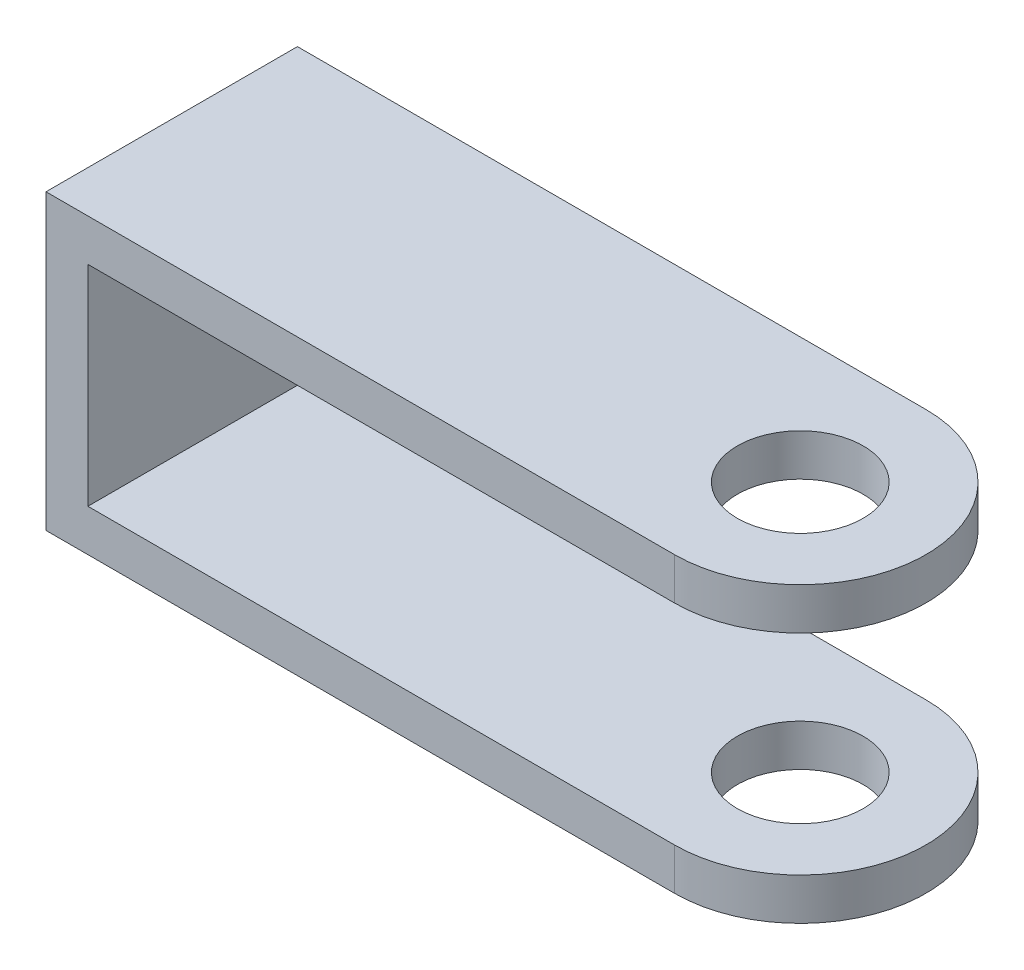
ISO-10303-21;
HEADER;
FILE_DESCRIPTION(('STEP AP214'),'2;1');
FILE_NAME('part.step','',(''),(''),'','','');
FILE_SCHEMA(('AUTOMOTIVE_DESIGN { 1 0 10303 214 1 1 1 1 }'));
ENDSEC;
DATA;
#1=APPLICATION_CONTEXT('core data for automotive mechanical design processes');
#2=APPLICATION_PROTOCOL_DEFINITION('international standard','automotive_design',2000,#1);
#3=PRODUCT_CONTEXT('',#1,'mechanical');
#4=PRODUCT('Part','Part','',(#3));
#5=PRODUCT_RELATED_PRODUCT_CATEGORY('part','',(#4));
#6=PRODUCT_DEFINITION_FORMATION('','',#4);
#7=PRODUCT_DEFINITION_CONTEXT('part definition',#1,'design');
#8=PRODUCT_DEFINITION('design','',#6,#7);
#9=PRODUCT_DEFINITION_SHAPE('','',#8);
#10=(LENGTH_UNIT() NAMED_UNIT(*) SI_UNIT(.MILLI.,.METRE.));
#11=(NAMED_UNIT(*) PLANE_ANGLE_UNIT() SI_UNIT($,.RADIAN.));
#12=(NAMED_UNIT(*) SI_UNIT($,.STERADIAN.) SOLID_ANGLE_UNIT());
#13=UNCERTAINTY_MEASURE_WITH_UNIT(LENGTH_MEASURE(1.E-05),#10,'distance_accuracy_value','');
#14=(GEOMETRIC_REPRESENTATION_CONTEXT(3) GLOBAL_UNCERTAINTY_ASSIGNED_CONTEXT((#13)) GLOBAL_UNIT_ASSIGNED_CONTEXT((#10,
#11,#12)) REPRESENTATION_CONTEXT('',''));
#15=CARTESIAN_POINT('',(0.,0.,0.));
#16=DIRECTION('',(0.,0.,1.));
#17=DIRECTION('',(1.,0.,0.));
#18=AXIS2_PLACEMENT_3D('',#15,#16,#17);
#19=CARTESIAN_POINT('',(10.,70.,30.));
#20=DIRECTION('',(-1.,0.,0.));
#21=DIRECTION('',(0.,0.,1.));
#22=AXIS2_PLACEMENT_3D('',#19,#20,#21);
#23=PLANE('',#22);
#24=DIRECTION('',(0.,0.,-1.));
#25=VECTOR('',#24,1.);
#26=CARTESIAN_POINT('',(10.,60.,30.));
#27=LINE('',#26,#25);
#28=CARTESIAN_POINT('',(10.,60.,30.));
#29=VERTEX_POINT('',#28);
#30=CARTESIAN_POINT('',(10.,60.,-30.));
#31=VERTEX_POINT('',#30);
#32=EDGE_CURVE('E11',#29,#31,#27,.T.);
#33=ORIENTED_EDGE('',*,*,#32,.F.);
#34=DIRECTION('',(0.,-1.,0.));
#35=VECTOR('',#34,1.);
#36=CARTESIAN_POINT('',(10.,70.,30.));
#37=LINE('',#36,#35);
#38=CARTESIAN_POINT('',(10.,10.,30.));
#39=VERTEX_POINT('',#38);
#40=EDGE_CURVE('E49',#29,#39,#37,.T.);
#41=ORIENTED_EDGE('',*,*,#40,.T.);
#42=DIRECTION('',(0.,0.,-1.));
#43=VECTOR('',#42,1.);
#44=CARTESIAN_POINT('',(10.,10.,30.));
#45=LINE('',#44,#43);
#46=CARTESIAN_POINT('',(10.,10.,-30.));
#47=VERTEX_POINT('',#46);
#48=EDGE_CURVE('E129',#39,#47,#45,.T.);
#49=ORIENTED_EDGE('',*,*,#48,.T.);
#50=DIRECTION('',(0.,-1.,0.));
#51=VECTOR('',#50,1.);
#52=CARTESIAN_POINT('',(10.,70.,-30.));
#53=LINE('',#52,#51);
#54=EDGE_CURVE('E137',#31,#47,#53,.T.);
#55=ORIENTED_EDGE('',*,*,#54,.F.);
#56=EDGE_LOOP('',(#33,#41,#49,#55));
#57=FACE_BOUND('',#56,.T.);
#58=ADVANCED_FACE('F34',(#57),#23,.F.);
#59=CARTESIAN_POINT('',(150.,10.,0.));
#60=DIRECTION('',(0.,-1.,0.));
#61=DIRECTION('',(0.,0.,-1.));
#62=AXIS2_PLACEMENT_3D('',#59,#60,#61);
#63=PLANE('',#62);
#64=CARTESIAN_POINT('',(150.,10.,0.));
#65=DIRECTION('',(0.,1.,0.));
#66=DIRECTION('',(0.,0.,1.));
#67=AXIS2_PLACEMENT_3D('',#64,#65,#66);
#68=CIRCLE('',#67,15.);
#69=CARTESIAN_POINT('',(150.,10.,15.));
#70=VERTEX_POINT('',#69);
#71=EDGE_CURVE('E102',#70,#70,#68,.T.);
#72=ORIENTED_EDGE('',*,*,#71,.F.);
#73=EDGE_LOOP('',(#72));
#74=FACE_BOUND('',#73,.T.);
#75=ORIENTED_EDGE('',*,*,#48,.F.);
#76=DIRECTION('',(1.,0.,0.));
#77=VECTOR('',#76,1.);
#78=CARTESIAN_POINT('',(150.,10.,30.));
#79=LINE('',#78,#77);
#80=CARTESIAN_POINT('',(150.,10.,30.));
#81=VERTEX_POINT('',#80);
#82=EDGE_CURVE('E118',#39,#81,#79,.T.);
#83=ORIENTED_EDGE('',*,*,#82,.T.);
#84=CARTESIAN_POINT('',(150.,10.,0.));
#85=DIRECTION('',(0.,1.,0.));
#86=DIRECTION('',(0.,0.,-1.));
#87=AXIS2_PLACEMENT_3D('',#84,#85,#86);
#88=CIRCLE('',#87,30.);
#89=CARTESIAN_POINT('',(150.,10.,-30.));
#90=VERTEX_POINT('',#89);
#91=EDGE_CURVE('E58',#81,#90,#88,.T.);
#92=ORIENTED_EDGE('',*,*,#91,.T.);
#93=DIRECTION('',(-1.,0.,0.));
#94=VECTOR('',#93,1.);
#95=CARTESIAN_POINT('',(0.,10.,-30.));
#96=LINE('',#95,#94);
#97=EDGE_CURVE('E87',#90,#47,#96,.T.);
#98=ORIENTED_EDGE('',*,*,#97,.T.);
#99=EDGE_LOOP('',(#75,#83,#92,#98));
#100=FACE_BOUND('',#99,.T.);
#101=ADVANCED_FACE('F198',(#74,#100),#63,.F.);
#102=CARTESIAN_POINT('',(150.,0.,0.));
#103=DIRECTION('',(0.,-1.,0.));
#104=DIRECTION('',(0.,0.,-1.));
#105=AXIS2_PLACEMENT_3D('',#102,#103,#104);
#106=PLANE('',#105);
#107=DIRECTION('',(-1.,0.,0.));
#108=VECTOR('',#107,1.);
#109=CARTESIAN_POINT('',(0.,0.,-30.));
#110=LINE('',#109,#108);
#111=CARTESIAN_POINT('',(150.,0.,-30.));
#112=VERTEX_POINT('',#111);
#113=CARTESIAN_POINT('',(0.,0.,-30.));
#114=VERTEX_POINT('',#113);
#115=EDGE_CURVE('E94',#112,#114,#110,.T.);
#116=ORIENTED_EDGE('',*,*,#115,.F.);
#117=CARTESIAN_POINT('',(150.,0.,0.));
#118=DIRECTION('',(0.,1.,0.));
#119=DIRECTION('',(0.,0.,-1.));
#120=AXIS2_PLACEMENT_3D('',#117,#118,#119);
#121=CIRCLE('',#120,30.);
#122=CARTESIAN_POINT('',(150.,0.,30.));
#123=VERTEX_POINT('',#122);
#124=EDGE_CURVE('E77',#123,#112,#121,.T.);
#125=ORIENTED_EDGE('',*,*,#124,.F.);
#126=DIRECTION('',(1.,0.,0.));
#127=VECTOR('',#126,1.);
#128=CARTESIAN_POINT('',(150.,0.,30.));
#129=LINE('',#128,#127);
#130=CARTESIAN_POINT('',(0.,0.,30.));
#131=VERTEX_POINT('',#130);
#132=EDGE_CURVE('E88',#131,#123,#129,.T.);
#133=ORIENTED_EDGE('',*,*,#132,.F.);
#134=DIRECTION('',(0.,0.,1.));
#135=VECTOR('',#134,1.);
#136=CARTESIAN_POINT('',(0.,0.,-30.));
#137=LINE('',#136,#135);
#138=EDGE_CURVE('E101',#114,#131,#137,.T.);
#139=ORIENTED_EDGE('',*,*,#138,.F.);
#140=EDGE_LOOP('',(#116,#125,#133,#139));
#141=FACE_BOUND('',#140,.T.);
#142=CARTESIAN_POINT('',(150.,0.,0.));
#143=DIRECTION('',(0.,1.,0.));
#144=DIRECTION('',(0.,0.,1.));
#145=AXIS2_PLACEMENT_3D('',#142,#143,#144);
#146=CIRCLE('',#145,15.);
#147=CARTESIAN_POINT('',(150.,0.,15.));
#148=VERTEX_POINT('',#147);
#149=EDGE_CURVE('E106',#148,#148,#146,.T.);
#150=ORIENTED_EDGE('',*,*,#149,.T.);
#151=EDGE_LOOP('',(#150));
#152=FACE_BOUND('',#151,.T.);
#153=ADVANCED_FACE('F98',(#141,#152),#106,.T.);
#154=CARTESIAN_POINT('',(0.,10.,-30.));
#155=DIRECTION('',(0.,0.,1.));
#156=DIRECTION('',(1.,0.,0.));
#157=AXIS2_PLACEMENT_3D('',#154,#155,#156);
#158=PLANE('',#157);
#159=DIRECTION('',(-1.,0.,0.));
#160=VECTOR('',#159,1.);
#161=CARTESIAN_POINT('',(0.,70.,-30.));
#162=LINE('',#161,#160);
#163=CARTESIAN_POINT('',(150.,70.,-30.));
#164=VERTEX_POINT('',#163);
#165=CARTESIAN_POINT('',(0.,70.,-30.));
#166=VERTEX_POINT('',#165);
#167=EDGE_CURVE('E127',#164,#166,#162,.T.);
#168=ORIENTED_EDGE('',*,*,#167,.F.);
#169=DIRECTION('',(0.,1.,0.));
#170=VECTOR('',#169,1.);
#171=CARTESIAN_POINT('',(150.,60.,-30.));
#172=LINE('',#171,#170);
#173=CARTESIAN_POINT('',(150.,60.,-30.));
#174=VERTEX_POINT('',#173);
#175=EDGE_CURVE('E132',#174,#164,#172,.T.);
#176=ORIENTED_EDGE('',*,*,#175,.F.);
#177=DIRECTION('',(-1.,0.,0.));
#178=VECTOR('',#177,1.);
#179=CARTESIAN_POINT('',(0.,60.,-30.));
#180=LINE('',#179,#178);
#181=EDGE_CURVE('E160',#174,#31,#180,.T.);
#182=ORIENTED_EDGE('',*,*,#181,.T.);
#183=ORIENTED_EDGE('',*,*,#54,.T.);
#184=ORIENTED_EDGE('',*,*,#97,.F.);
#185=DIRECTION('',(0.,-1.,0.));
#186=VECTOR('',#185,1.);
#187=CARTESIAN_POINT('',(150.,10.,-30.));
#188=LINE('',#187,#186);
#189=EDGE_CURVE('E80',#90,#112,#188,.T.);
#190=ORIENTED_EDGE('',*,*,#189,.T.);
#191=ORIENTED_EDGE('',*,*,#115,.T.);
#192=DIRECTION('',(0.,-1.,0.));
#193=VECTOR('',#192,1.);
#194=CARTESIAN_POINT('',(0.,10.,-30.));
#195=LINE('',#194,#193);
#196=EDGE_CURVE('E42',#166,#114,#195,.T.);
#197=ORIENTED_EDGE('',*,*,#196,.F.);
#198=EDGE_LOOP('',(#168,#176,#182,#183,#184,#190,#191,#197));
#199=FACE_BOUND('',#198,.T.);
#200=ADVANCED_FACE('F36',(#199),#158,.F.);
#201=CARTESIAN_POINT('',(0.,10.,-30.));
#202=DIRECTION('',(1.,0.,0.));
#203=DIRECTION('',(0.,0.,-1.));
#204=AXIS2_PLACEMENT_3D('',#201,#202,#203);
#205=PLANE('',#204);
#206=ORIENTED_EDGE('',*,*,#196,.T.);
#207=ORIENTED_EDGE('',*,*,#138,.T.);
#208=DIRECTION('',(0.,-1.,0.));
#209=VECTOR('',#208,1.);
#210=CARTESIAN_POINT('',(0.,10.,30.));
#211=LINE('',#210,#209);
#212=CARTESIAN_POINT('',(0.,70.,30.));
#213=VERTEX_POINT('',#212);
#214=EDGE_CURVE('E113',#213,#131,#211,.T.);
#215=ORIENTED_EDGE('',*,*,#214,.F.);
#216=DIRECTION('',(0.,0.,1.));
#217=VECTOR('',#216,1.);
#218=CARTESIAN_POINT('',(0.,70.,30.));
#219=LINE('',#218,#217);
#220=EDGE_CURVE('E131',#166,#213,#219,.T.);
#221=ORIENTED_EDGE('',*,*,#220,.F.);
#222=EDGE_LOOP('',(#206,#207,#215,#221));
#223=FACE_BOUND('',#222,.T.);
#224=ADVANCED_FACE('F211',(#223),#205,.F.);
#225=CARTESIAN_POINT('',(150.,10.,30.));
#226=DIRECTION('',(0.,0.,-1.));
#227=DIRECTION('',(-1.,0.,0.));
#228=AXIS2_PLACEMENT_3D('',#225,#226,#227);
#229=PLANE('',#228);
#230=ORIENTED_EDGE('',*,*,#214,.T.);
#231=ORIENTED_EDGE('',*,*,#132,.T.);
#232=DIRECTION('',(0.,-1.,0.));
#233=VECTOR('',#232,1.);
#234=CARTESIAN_POINT('',(150.,10.,30.));
#235=LINE('',#234,#233);
#236=EDGE_CURVE('E83',#81,#123,#235,.T.);
#237=ORIENTED_EDGE('',*,*,#236,.F.);
#238=ORIENTED_EDGE('',*,*,#82,.F.);
#239=ORIENTED_EDGE('',*,*,#40,.F.);
#240=DIRECTION('',(1.,0.,0.));
#241=VECTOR('',#240,1.);
#242=CARTESIAN_POINT('',(150.,60.,30.));
#243=LINE('',#242,#241);
#244=CARTESIAN_POINT('',(150.,60.,30.));
#245=VERTEX_POINT('',#244);
#246=EDGE_CURVE('E157',#29,#245,#243,.T.);
#247=ORIENTED_EDGE('',*,*,#246,.T.);
#248=DIRECTION('',(0.,1.,0.));
#249=VECTOR('',#248,1.);
#250=CARTESIAN_POINT('',(150.,60.,30.));
#251=LINE('',#250,#249);
#252=CARTESIAN_POINT('',(150.,70.,30.));
#253=VERTEX_POINT('',#252);
#254=EDGE_CURVE('E155',#245,#253,#251,.T.);
#255=ORIENTED_EDGE('',*,*,#254,.T.);
#256=DIRECTION('',(1.,0.,0.));
#257=VECTOR('',#256,1.);
#258=CARTESIAN_POINT('',(0.,70.,30.));
#259=LINE('',#258,#257);
#260=EDGE_CURVE('E142',#213,#253,#259,.T.);
#261=ORIENTED_EDGE('',*,*,#260,.F.);
#262=EDGE_LOOP('',(#230,#231,#237,#238,#239,#247,#255,#261));
#263=FACE_BOUND('',#262,.T.);
#264=ADVANCED_FACE('F209',(#263),#229,.F.);
#265=CARTESIAN_POINT('',(150.,10.,0.));
#266=DIRECTION('',(0.,-1.,0.));
#267=DIRECTION('',(0.,0.,-1.));
#268=AXIS2_PLACEMENT_3D('',#265,#266,#267);
#269=CYLINDRICAL_SURFACE('',#268,30.);
#270=ORIENTED_EDGE('',*,*,#124,.T.);
#271=ORIENTED_EDGE('',*,*,#189,.F.);
#272=ORIENTED_EDGE('',*,*,#91,.F.);
#273=ORIENTED_EDGE('',*,*,#236,.T.);
#274=EDGE_LOOP('',(#270,#271,#272,#273));
#275=FACE_BOUND('',#274,.T.);
#276=ADVANCED_FACE('F79',(#275),#269,.T.);
#277=CARTESIAN_POINT('',(150.,10.,0.));
#278=DIRECTION('',(0.,-1.,0.));
#279=DIRECTION('',(0.,0.,-1.));
#280=AXIS2_PLACEMENT_3D('',#277,#278,#279);
#281=CYLINDRICAL_SURFACE('',#280,15.);
#282=ORIENTED_EDGE('',*,*,#71,.T.);
#283=EDGE_LOOP('',(#282));
#284=FACE_BOUND('',#283,.T.);
#285=ORIENTED_EDGE('',*,*,#149,.F.);
#286=EDGE_LOOP('',(#285));
#287=FACE_BOUND('',#286,.T.);
#288=ADVANCED_FACE('F186',(#284,#287),#281,.F.);
#289=CARTESIAN_POINT('',(0.,70.,0.));
#290=DIRECTION('',(0.,-1.,0.));
#291=DIRECTION('',(0.,0.,-1.));
#292=AXIS2_PLACEMENT_3D('',#289,#290,#291);
#293=PLANE('',#292);
#294=ORIENTED_EDGE('',*,*,#220,.T.);
#295=ORIENTED_EDGE('',*,*,#260,.T.);
#296=CARTESIAN_POINT('',(150.,70.,0.));
#297=DIRECTION('',(0.,1.,0.));
#298=DIRECTION('',(0.,0.,-1.));
#299=AXIS2_PLACEMENT_3D('',#296,#297,#298);
#300=CIRCLE('',#299,30.);
#301=EDGE_CURVE('E158',#253,#164,#300,.T.);
#302=ORIENTED_EDGE('',*,*,#301,.T.);
#303=ORIENTED_EDGE('',*,*,#167,.T.);
#304=EDGE_LOOP('',(#294,#295,#302,#303));
#305=FACE_BOUND('',#304,.T.);
#306=CARTESIAN_POINT('',(150.,70.,0.));
#307=DIRECTION('',(0.,1.,0.));
#308=DIRECTION('',(0.,0.,1.));
#309=AXIS2_PLACEMENT_3D('',#306,#307,#308);
#310=CIRCLE('',#309,15.);
#311=CARTESIAN_POINT('',(150.,70.,15.));
#312=VERTEX_POINT('',#311);
#313=EDGE_CURVE('E168',#312,#312,#310,.T.);
#314=ORIENTED_EDGE('',*,*,#313,.F.);
#315=EDGE_LOOP('',(#314));
#316=FACE_BOUND('',#315,.T.);
#317=ADVANCED_FACE('F184',(#305,#316),#293,.F.);
#318=CARTESIAN_POINT('',(150.,60.,0.));
#319=DIRECTION('',(0.,1.,0.));
#320=DIRECTION('',(0.,0.,-1.));
#321=AXIS2_PLACEMENT_3D('',#318,#319,#320);
#322=PLANE('',#321);
#323=CARTESIAN_POINT('',(150.,60.,0.));
#324=DIRECTION('',(0.,1.,0.));
#325=DIRECTION('',(0.,0.,1.));
#326=AXIS2_PLACEMENT_3D('',#323,#324,#325);
#327=CIRCLE('',#326,15.);
#328=CARTESIAN_POINT('',(150.,60.,15.));
#329=VERTEX_POINT('',#328);
#330=EDGE_CURVE('E161',#329,#329,#327,.T.);
#331=ORIENTED_EDGE('',*,*,#330,.T.);
#332=EDGE_LOOP('',(#331));
#333=FACE_BOUND('',#332,.T.);
#334=ORIENTED_EDGE('',*,*,#246,.F.);
#335=ORIENTED_EDGE('',*,*,#32,.T.);
#336=ORIENTED_EDGE('',*,*,#181,.F.);
#337=CARTESIAN_POINT('',(150.,60.,0.));
#338=DIRECTION('',(0.,1.,0.));
#339=DIRECTION('',(0.,0.,-1.));
#340=AXIS2_PLACEMENT_3D('',#337,#338,#339);
#341=CIRCLE('',#340,30.);
#342=EDGE_CURVE('E164',#245,#174,#341,.T.);
#343=ORIENTED_EDGE('',*,*,#342,.F.);
#344=EDGE_LOOP('',(#334,#335,#336,#343));
#345=FACE_BOUND('',#344,.T.);
#346=ADVANCED_FACE('F174',(#333,#345),#322,.F.);
#347=CARTESIAN_POINT('',(150.,60.,0.));
#348=DIRECTION('',(0.,1.,0.));
#349=DIRECTION('',(0.,0.,1.));
#350=AXIS2_PLACEMENT_3D('',#347,#348,#349);
#351=CYLINDRICAL_SURFACE('',#350,30.);
#352=ORIENTED_EDGE('',*,*,#301,.F.);
#353=ORIENTED_EDGE('',*,*,#254,.F.);
#354=ORIENTED_EDGE('',*,*,#342,.T.);
#355=ORIENTED_EDGE('',*,*,#175,.T.);
#356=EDGE_LOOP('',(#352,#353,#354,#355));
#357=FACE_BOUND('',#356,.T.);
#358=ADVANCED_FACE('F180',(#357),#351,.T.);
#359=CARTESIAN_POINT('',(150.,60.,0.));
#360=DIRECTION('',(0.,1.,0.));
#361=DIRECTION('',(0.,0.,1.));
#362=AXIS2_PLACEMENT_3D('',#359,#360,#361);
#363=CYLINDRICAL_SURFACE('',#362,15.);
#364=ORIENTED_EDGE('',*,*,#330,.F.);
#365=EDGE_LOOP('',(#364));
#366=FACE_BOUND('',#365,.T.);
#367=ORIENTED_EDGE('',*,*,#313,.T.);
#368=EDGE_LOOP('',(#367));
#369=FACE_BOUND('',#368,.T.);
#370=ADVANCED_FACE('F177',(#366,#369),#363,.F.);
#371=CLOSED_SHELL('',(#58,#101,#153,#200,#224,#264,#276,#288,#317,#346,#358,#370));
#372=MANIFOLD_SOLID_BREP('B2',#371);
#373=ADVANCED_BREP_SHAPE_REPRESENTATION('',(#18,#372),#14);
#374=SHAPE_DEFINITION_REPRESENTATION(#9,#373);
ENDSEC;
END-ISO-10303-21;
